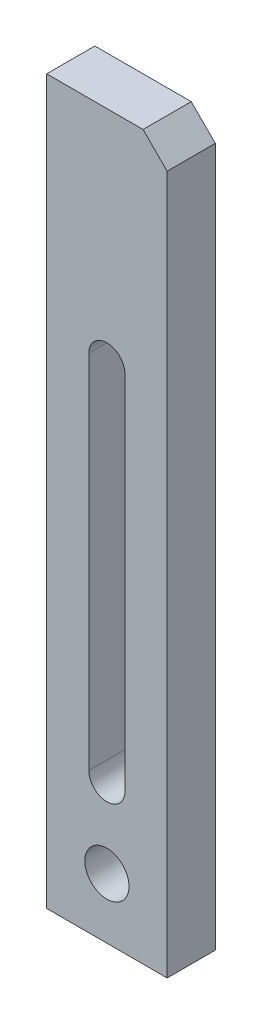
ISO-10303-21;
HEADER;
FILE_DESCRIPTION(('STEP AP214'),'2;1');
FILE_NAME('part.step','',(''),(''),'','','');
FILE_SCHEMA(('AUTOMOTIVE_DESIGN { 1 0 10303 214 1 1 1 1 }'));
ENDSEC;
DATA;
#1=APPLICATION_CONTEXT('core data for automotive mechanical design processes');
#2=APPLICATION_PROTOCOL_DEFINITION('international standard','automotive_design',2000,#1);
#3=PRODUCT_CONTEXT('',#1,'mechanical');
#4=PRODUCT('Part','Part','',(#3));
#5=PRODUCT_RELATED_PRODUCT_CATEGORY('part','',(#4));
#6=PRODUCT_DEFINITION_FORMATION('','',#4);
#7=PRODUCT_DEFINITION_CONTEXT('part definition',#1,'design');
#8=PRODUCT_DEFINITION('design','',#6,#7);
#9=PRODUCT_DEFINITION_SHAPE('','',#8);
#10=(LENGTH_UNIT() NAMED_UNIT(*) SI_UNIT(.MILLI.,.METRE.));
#11=(NAMED_UNIT(*) PLANE_ANGLE_UNIT() SI_UNIT($,.RADIAN.));
#12=(NAMED_UNIT(*) SI_UNIT($,.STERADIAN.) SOLID_ANGLE_UNIT());
#13=UNCERTAINTY_MEASURE_WITH_UNIT(LENGTH_MEASURE(1.E-05),#10,'distance_accuracy_value','');
#14=(GEOMETRIC_REPRESENTATION_CONTEXT(3) GLOBAL_UNCERTAINTY_ASSIGNED_CONTEXT((#13)) GLOBAL_UNIT_ASSIGNED_CONTEXT((#10,
#11,#12)) REPRESENTATION_CONTEXT('',''));
#15=CARTESIAN_POINT('',(0.,0.,0.));
#16=DIRECTION('',(0.,0.,1.));
#17=DIRECTION('',(1.,0.,0.));
#18=AXIS2_PLACEMENT_3D('',#15,#16,#17);
#19=CARTESIAN_POINT('',(15.,90.,12.));
#20=DIRECTION('',(-1.,0.,0.));
#21=DIRECTION('',(0.,-1.,0.));
#22=AXIS2_PLACEMENT_3D('',#19,#20,#21);
#23=PLANE('',#22);
#24=DIRECTION('',(0.,1.,0.));
#25=VECTOR('',#24,1.);
#26=CARTESIAN_POINT('',(15.,90.,0.));
#27=LINE('',#26,#25);
#28=CARTESIAN_POINT('',(15.,-90.,0.));
#29=VERTEX_POINT('',#28);
#30=CARTESIAN_POINT('',(15.,83.9999999999999,0.));
#31=VERTEX_POINT('',#30);
#32=EDGE_CURVE('E150',#29,#31,#27,.T.);
#33=ORIENTED_EDGE('',*,*,#32,.T.);
#34=DIRECTION('',(0.,0.,1.));
#35=VECTOR('',#34,1.);
#36=CARTESIAN_POINT('',(15.,83.9999999999999,12.));
#37=LINE('',#36,#35);
#38=CARTESIAN_POINT('',(15.,83.9999999999999,12.));
#39=VERTEX_POINT('',#38);
#40=EDGE_CURVE('E46',#31,#39,#37,.T.);
#41=ORIENTED_EDGE('',*,*,#40,.T.);
#42=DIRECTION('',(0.,1.,0.));
#43=VECTOR('',#42,1.);
#44=CARTESIAN_POINT('',(15.,90.,12.));
#45=LINE('',#44,#43);
#46=CARTESIAN_POINT('',(15.,-90.,12.));
#47=VERTEX_POINT('',#46);
#48=EDGE_CURVE('E159',#47,#39,#45,.T.);
#49=ORIENTED_EDGE('',*,*,#48,.F.);
#50=DIRECTION('',(0.,0.,-1.));
#51=VECTOR('',#50,1.);
#52=CARTESIAN_POINT('',(15.,-90.,12.));
#53=LINE('',#52,#51);
#54=EDGE_CURVE('E168',#47,#29,#53,.T.);
#55=ORIENTED_EDGE('',*,*,#54,.T.);
#56=EDGE_LOOP('',(#33,#41,#49,#55));
#57=FACE_BOUND('',#56,.T.);
#58=ADVANCED_FACE('F37',(#57),#23,.F.);
#59=CARTESIAN_POINT('',(-15.,90.,12.));
#60=DIRECTION('',(0.,-1.,0.));
#61=DIRECTION('',(0.,0.,-1.));
#62=AXIS2_PLACEMENT_3D('',#59,#60,#61);
#63=PLANE('',#62);
#64=DIRECTION('',(-1.,0.,0.));
#65=VECTOR('',#64,1.);
#66=CARTESIAN_POINT('',(-15.,90.,12.));
#67=LINE('',#66,#65);
#68=CARTESIAN_POINT('',(8.99999999999995,90.,12.));
#69=VERTEX_POINT('',#68);
#70=CARTESIAN_POINT('',(-15.,90.,12.));
#71=VERTEX_POINT('',#70);
#72=EDGE_CURVE('E161',#69,#71,#67,.T.);
#73=ORIENTED_EDGE('',*,*,#72,.F.);
#74=DIRECTION('',(0.,0.,-1.));
#75=VECTOR('',#74,1.);
#76=CARTESIAN_POINT('',(8.99999999999995,90.,12.));
#77=LINE('',#76,#75);
#78=CARTESIAN_POINT('',(8.99999999999995,90.,0.));
#79=VERTEX_POINT('',#78);
#80=EDGE_CURVE('E183',#69,#79,#77,.T.);
#81=ORIENTED_EDGE('',*,*,#80,.T.);
#82=DIRECTION('',(-1.,0.,0.));
#83=VECTOR('',#82,1.);
#84=CARTESIAN_POINT('',(-15.,90.,0.));
#85=LINE('',#84,#83);
#86=CARTESIAN_POINT('',(-15.,90.,0.));
#87=VERTEX_POINT('',#86);
#88=EDGE_CURVE('E170',#79,#87,#85,.T.);
#89=ORIENTED_EDGE('',*,*,#88,.T.);
#90=DIRECTION('',(0.,0.,-1.));
#91=VECTOR('',#90,1.);
#92=CARTESIAN_POINT('',(-15.,90.,12.));
#93=LINE('',#92,#91);
#94=EDGE_CURVE('E180',#71,#87,#93,.T.);
#95=ORIENTED_EDGE('',*,*,#94,.F.);
#96=EDGE_LOOP('',(#73,#81,#89,#95));
#97=FACE_BOUND('',#96,.T.);
#98=ADVANCED_FACE('F189',(#97),#63,.F.);
#99=CARTESIAN_POINT('',(-15.,90.,12.));
#100=DIRECTION('',(1.,0.,0.));
#101=DIRECTION('',(0.,1.,0.));
#102=AXIS2_PLACEMENT_3D('',#99,#100,#101);
#103=PLANE('',#102);
#104=DIRECTION('',(0.,-1.,0.));
#105=VECTOR('',#104,1.);
#106=CARTESIAN_POINT('',(-15.,90.,0.));
#107=LINE('',#106,#105);
#108=CARTESIAN_POINT('',(-15.,-90.,0.));
#109=VERTEX_POINT('',#108);
#110=EDGE_CURVE('E172',#87,#109,#107,.T.);
#111=ORIENTED_EDGE('',*,*,#110,.T.);
#112=DIRECTION('',(0.,0.,-1.));
#113=VECTOR('',#112,1.);
#114=CARTESIAN_POINT('',(-15.,-90.,12.));
#115=LINE('',#114,#113);
#116=CARTESIAN_POINT('',(-15.,-90.,12.));
#117=VERTEX_POINT('',#116);
#118=EDGE_CURVE('E177',#117,#109,#115,.T.);
#119=ORIENTED_EDGE('',*,*,#118,.F.);
#120=DIRECTION('',(0.,-1.,0.));
#121=VECTOR('',#120,1.);
#122=CARTESIAN_POINT('',(-15.,90.,12.));
#123=LINE('',#122,#121);
#124=EDGE_CURVE('E164',#71,#117,#123,.T.);
#125=ORIENTED_EDGE('',*,*,#124,.F.);
#126=ORIENTED_EDGE('',*,*,#94,.T.);
#127=EDGE_LOOP('',(#111,#119,#125,#126));
#128=FACE_BOUND('',#127,.T.);
#129=ADVANCED_FACE('F197',(#128),#103,.F.);
#130=CARTESIAN_POINT('',(-15.,-90.,12.));
#131=DIRECTION('',(0.,1.,0.));
#132=DIRECTION('',(0.,0.,1.));
#133=AXIS2_PLACEMENT_3D('',#130,#131,#132);
#134=PLANE('',#133);
#135=DIRECTION('',(1.,0.,0.));
#136=VECTOR('',#135,1.);
#137=CARTESIAN_POINT('',(-15.,-90.,0.));
#138=LINE('',#137,#136);
#139=EDGE_CURVE('E162',#109,#29,#138,.T.);
#140=ORIENTED_EDGE('',*,*,#139,.T.);
#141=ORIENTED_EDGE('',*,*,#54,.F.);
#142=DIRECTION('',(1.,0.,0.));
#143=VECTOR('',#142,1.);
#144=CARTESIAN_POINT('',(-15.,-90.,12.));
#145=LINE('',#144,#143);
#146=EDGE_CURVE('E166',#117,#47,#145,.T.);
#147=ORIENTED_EDGE('',*,*,#146,.F.);
#148=ORIENTED_EDGE('',*,*,#118,.T.);
#149=EDGE_LOOP('',(#140,#141,#147,#148));
#150=FACE_BOUND('',#149,.T.);
#151=ADVANCED_FACE('F201',(#150),#134,.F.);
#152=CARTESIAN_POINT('',(0.,0.,12.));
#153=DIRECTION('',(0.,0.,1.));
#154=DIRECTION('',(1.,0.,0.));
#155=AXIS2_PLACEMENT_3D('',#152,#153,#154);
#156=PLANE('',#155);
#157=CARTESIAN_POINT('',(0.,35.,12.));
#158=DIRECTION('',(0.,0.,1.));
#159=DIRECTION('',(1.,0.,0.));
#160=AXIS2_PLACEMENT_3D('',#157,#158,#159);
#161=CIRCLE('',#160,4.5);
#162=CARTESIAN_POINT('',(4.49999999999998,35.,12.));
#163=VERTEX_POINT('',#162);
#164=CARTESIAN_POINT('',(-4.50000000000001,35.,12.));
#165=VERTEX_POINT('',#164);
#166=EDGE_CURVE('E116',#163,#165,#161,.T.);
#167=ORIENTED_EDGE('',*,*,#166,.F.);
#168=DIRECTION('',(0.,1.,0.));
#169=VECTOR('',#168,1.);
#170=CARTESIAN_POINT('',(4.49999999999998,35.,12.));
#171=LINE('',#170,#169);
#172=CARTESIAN_POINT('',(4.49999999999999,-55.,12.));
#173=VERTEX_POINT('',#172);
#174=EDGE_CURVE('E134',#173,#163,#171,.T.);
#175=ORIENTED_EDGE('',*,*,#174,.F.);
#176=CARTESIAN_POINT('',(0.,-55.,12.));
#177=DIRECTION('',(0.,0.,1.));
#178=DIRECTION('',(1.,0.,0.));
#179=AXIS2_PLACEMENT_3D('',#176,#177,#178);
#180=CIRCLE('',#179,4.5);
#181=CARTESIAN_POINT('',(-4.5,-55.,12.));
#182=VERTEX_POINT('',#181);
#183=EDGE_CURVE('E137',#182,#173,#180,.T.);
#184=ORIENTED_EDGE('',*,*,#183,.F.);
#185=DIRECTION('',(0.,-1.,0.));
#186=VECTOR('',#185,1.);
#187=CARTESIAN_POINT('',(-4.50000000000001,35.,12.));
#188=LINE('',#187,#186);
#189=EDGE_CURVE('E143',#165,#182,#188,.T.);
#190=ORIENTED_EDGE('',*,*,#189,.F.);
#191=EDGE_LOOP('',(#167,#175,#184,#190));
#192=FACE_BOUND('',#191,.T.);
#193=CARTESIAN_POINT('',(0.,-75.,12.));
#194=DIRECTION('',(0.,0.,1.));
#195=DIRECTION('',(1.,0.,0.));
#196=AXIS2_PLACEMENT_3D('',#193,#194,#195);
#197=CIRCLE('',#196,5.5);
#198=CARTESIAN_POINT('',(5.49999999999999,-75.,12.));
#199=VERTEX_POINT('',#198);
#200=EDGE_CURVE('E156',#199,#199,#197,.T.);
#201=ORIENTED_EDGE('',*,*,#200,.F.);
#202=EDGE_LOOP('',(#201));
#203=FACE_BOUND('',#202,.T.);
#204=ORIENTED_EDGE('',*,*,#48,.T.);
#205=DIRECTION('',(0.707106781186546,-0.707106781186549,0.));
#206=VECTOR('',#205,1.);
#207=CARTESIAN_POINT('',(49.5,49.4999999999997,12.));
#208=LINE('',#207,#206);
#209=EDGE_CURVE('E11',#39,#69,#208,.F.);
#210=ORIENTED_EDGE('',*,*,#209,.T.);
#211=ORIENTED_EDGE('',*,*,#72,.T.);
#212=ORIENTED_EDGE('',*,*,#124,.T.);
#213=ORIENTED_EDGE('',*,*,#146,.T.);
#214=EDGE_LOOP('',(#204,#210,#211,#212,#213));
#215=FACE_BOUND('',#214,.T.);
#216=ADVANCED_FACE('F204',(#192,#203,#215),#156,.T.);
#217=CARTESIAN_POINT('',(0.,0.,0.));
#218=DIRECTION('',(0.,0.,1.));
#219=DIRECTION('',(1.,0.,0.));
#220=AXIS2_PLACEMENT_3D('',#217,#218,#219);
#221=PLANE('',#220);
#222=DIRECTION('',(0.,1.,0.));
#223=VECTOR('',#222,1.);
#224=CARTESIAN_POINT('',(4.49999999999998,35.,0.));
#225=LINE('',#224,#223);
#226=CARTESIAN_POINT('',(4.49999999999999,-55.,0.));
#227=VERTEX_POINT('',#226);
#228=CARTESIAN_POINT('',(4.49999999999998,35.,0.));
#229=VERTEX_POINT('',#228);
#230=EDGE_CURVE('E121',#227,#229,#225,.T.);
#231=ORIENTED_EDGE('',*,*,#230,.T.);
#232=CARTESIAN_POINT('',(0.,35.,0.));
#233=DIRECTION('',(0.,0.,1.));
#234=DIRECTION('',(1.,0.,0.));
#235=AXIS2_PLACEMENT_3D('',#232,#233,#234);
#236=CIRCLE('',#235,4.5);
#237=CARTESIAN_POINT('',(-4.50000000000001,35.,0.));
#238=VERTEX_POINT('',#237);
#239=EDGE_CURVE('E113',#229,#238,#236,.T.);
#240=ORIENTED_EDGE('',*,*,#239,.T.);
#241=DIRECTION('',(0.,-1.,0.));
#242=VECTOR('',#241,1.);
#243=CARTESIAN_POINT('',(-4.50000000000001,35.,0.));
#244=LINE('',#243,#242);
#245=CARTESIAN_POINT('',(-4.5,-55.,0.));
#246=VERTEX_POINT('',#245);
#247=EDGE_CURVE('E125',#238,#246,#244,.T.);
#248=ORIENTED_EDGE('',*,*,#247,.T.);
#249=CARTESIAN_POINT('',(0.,-55.,0.));
#250=DIRECTION('',(0.,0.,1.));
#251=DIRECTION('',(1.,0.,0.));
#252=AXIS2_PLACEMENT_3D('',#249,#250,#251);
#253=CIRCLE('',#252,4.5);
#254=EDGE_CURVE('E129',#246,#227,#253,.T.);
#255=ORIENTED_EDGE('',*,*,#254,.T.);
#256=EDGE_LOOP('',(#231,#240,#248,#255));
#257=FACE_BOUND('',#256,.T.);
#258=CARTESIAN_POINT('',(0.,-75.,0.));
#259=DIRECTION('',(0.,0.,1.));
#260=DIRECTION('',(1.,0.,0.));
#261=AXIS2_PLACEMENT_3D('',#258,#259,#260);
#262=CIRCLE('',#261,5.5);
#263=CARTESIAN_POINT('',(5.49999999999999,-75.,0.));
#264=VERTEX_POINT('',#263);
#265=EDGE_CURVE('E144',#264,#264,#262,.T.);
#266=ORIENTED_EDGE('',*,*,#265,.T.);
#267=EDGE_LOOP('',(#266));
#268=FACE_BOUND('',#267,.T.);
#269=ORIENTED_EDGE('',*,*,#88,.F.);
#270=DIRECTION('',(-0.707106781186546,0.707106781186549,0.));
#271=VECTOR('',#270,1.);
#272=CARTESIAN_POINT('',(8.99999999999995,90.,0.));
#273=LINE('',#272,#271);
#274=EDGE_CURVE('E60',#79,#31,#273,.F.);
#275=ORIENTED_EDGE('',*,*,#274,.T.);
#276=ORIENTED_EDGE('',*,*,#32,.F.);
#277=ORIENTED_EDGE('',*,*,#139,.F.);
#278=ORIENTED_EDGE('',*,*,#110,.F.);
#279=EDGE_LOOP('',(#269,#275,#276,#277,#278));
#280=FACE_BOUND('',#279,.T.);
#281=ADVANCED_FACE('F131',(#257,#268,#280),#221,.F.);
#282=CARTESIAN_POINT('',(0.,-75.,0.));
#283=DIRECTION('',(0.,0.,1.));
#284=DIRECTION('',(1.,0.,0.));
#285=AXIS2_PLACEMENT_3D('',#282,#283,#284);
#286=CYLINDRICAL_SURFACE('',#285,5.5);
#287=ORIENTED_EDGE('',*,*,#265,.F.);
#288=EDGE_LOOP('',(#287));
#289=FACE_BOUND('',#288,.T.);
#290=ORIENTED_EDGE('',*,*,#200,.T.);
#291=EDGE_LOOP('',(#290));
#292=FACE_BOUND('',#291,.T.);
#293=ADVANCED_FACE('F223',(#289,#292),#286,.F.);
#294=CARTESIAN_POINT('',(0.,35.,0.));
#295=DIRECTION('',(0.,0.,1.));
#296=DIRECTION('',(1.,0.,0.));
#297=AXIS2_PLACEMENT_3D('',#294,#295,#296);
#298=CYLINDRICAL_SURFACE('',#297,4.5);
#299=ORIENTED_EDGE('',*,*,#166,.T.);
#300=DIRECTION('',(0.,0.,1.));
#301=VECTOR('',#300,1.);
#302=CARTESIAN_POINT('',(-4.50000000000001,35.,0.));
#303=LINE('',#302,#301);
#304=EDGE_CURVE('E109',#238,#165,#303,.T.);
#305=ORIENTED_EDGE('',*,*,#304,.F.);
#306=ORIENTED_EDGE('',*,*,#239,.F.);
#307=DIRECTION('',(0.,0.,1.));
#308=VECTOR('',#307,1.);
#309=CARTESIAN_POINT('',(4.49999999999998,35.,0.));
#310=LINE('',#309,#308);
#311=EDGE_CURVE('E148',#229,#163,#310,.T.);
#312=ORIENTED_EDGE('',*,*,#311,.T.);
#313=EDGE_LOOP('',(#299,#305,#306,#312));
#314=FACE_BOUND('',#313,.T.);
#315=ADVANCED_FACE('F111',(#314),#298,.F.);
#316=CARTESIAN_POINT('',(4.49999999999998,35.,0.));
#317=DIRECTION('',(1.,0.,0.));
#318=DIRECTION('',(0.,1.,0.));
#319=AXIS2_PLACEMENT_3D('',#316,#317,#318);
#320=PLANE('',#319);
#321=ORIENTED_EDGE('',*,*,#174,.T.);
#322=ORIENTED_EDGE('',*,*,#311,.F.);
#323=ORIENTED_EDGE('',*,*,#230,.F.);
#324=DIRECTION('',(0.,0.,1.));
#325=VECTOR('',#324,1.);
#326=CARTESIAN_POINT('',(4.49999999999999,-55.,0.));
#327=LINE('',#326,#325);
#328=EDGE_CURVE('E151',#227,#173,#327,.T.);
#329=ORIENTED_EDGE('',*,*,#328,.T.);
#330=EDGE_LOOP('',(#321,#322,#323,#329));
#331=FACE_BOUND('',#330,.T.);
#332=ADVANCED_FACE('F231',(#331),#320,.F.);
#333=CARTESIAN_POINT('',(0.,-55.,0.));
#334=DIRECTION('',(0.,0.,1.));
#335=DIRECTION('',(1.,0.,0.));
#336=AXIS2_PLACEMENT_3D('',#333,#334,#335);
#337=CYLINDRICAL_SURFACE('',#336,4.5);
#338=ORIENTED_EDGE('',*,*,#183,.T.);
#339=ORIENTED_EDGE('',*,*,#328,.F.);
#340=ORIENTED_EDGE('',*,*,#254,.F.);
#341=DIRECTION('',(0.,0.,1.));
#342=VECTOR('',#341,1.);
#343=CARTESIAN_POINT('',(-4.5,-55.,0.));
#344=LINE('',#343,#342);
#345=EDGE_CURVE('E120',#246,#182,#344,.T.);
#346=ORIENTED_EDGE('',*,*,#345,.T.);
#347=EDGE_LOOP('',(#338,#339,#340,#346));
#348=FACE_BOUND('',#347,.T.);
#349=ADVANCED_FACE('F209',(#348),#337,.F.);
#350=CARTESIAN_POINT('',(-4.50000000000001,35.,0.));
#351=DIRECTION('',(-1.,0.,0.));
#352=DIRECTION('',(0.,-1.,0.));
#353=AXIS2_PLACEMENT_3D('',#350,#351,#352);
#354=PLANE('',#353);
#355=ORIENTED_EDGE('',*,*,#189,.T.);
#356=ORIENTED_EDGE('',*,*,#345,.F.);
#357=ORIENTED_EDGE('',*,*,#247,.F.);
#358=ORIENTED_EDGE('',*,*,#304,.T.);
#359=EDGE_LOOP('',(#355,#356,#357,#358));
#360=FACE_BOUND('',#359,.T.);
#361=ADVANCED_FACE('F126',(#360),#354,.F.);
#362=CARTESIAN_POINT('',(8.99999999999995,90.,12.));
#363=DIRECTION('',(-0.707106781186549,-0.707106781186546,0.));
#364=DIRECTION('',(0.,0.,-1.));
#365=AXIS2_PLACEMENT_3D('',#362,#363,#364);
#366=PLANE('',#365);
#367=ORIENTED_EDGE('',*,*,#209,.F.);
#368=ORIENTED_EDGE('',*,*,#40,.F.);
#369=ORIENTED_EDGE('',*,*,#274,.F.);
#370=ORIENTED_EDGE('',*,*,#80,.F.);
#371=EDGE_LOOP('',(#367,#368,#369,#370));
#372=FACE_BOUND('',#371,.T.);
#373=ADVANCED_FACE('F40',(#372),#366,.F.);
#374=CLOSED_SHELL('',(#58,#98,#129,#151,#216,#281,#293,#315,#332,#349,#361,#373));
#375=MANIFOLD_SOLID_BREP('B2',#374);
#376=ADVANCED_BREP_SHAPE_REPRESENTATION('',(#18,#375),#14);
#377=SHAPE_DEFINITION_REPRESENTATION(#9,#376);
ENDSEC;
END-ISO-10303-21;
